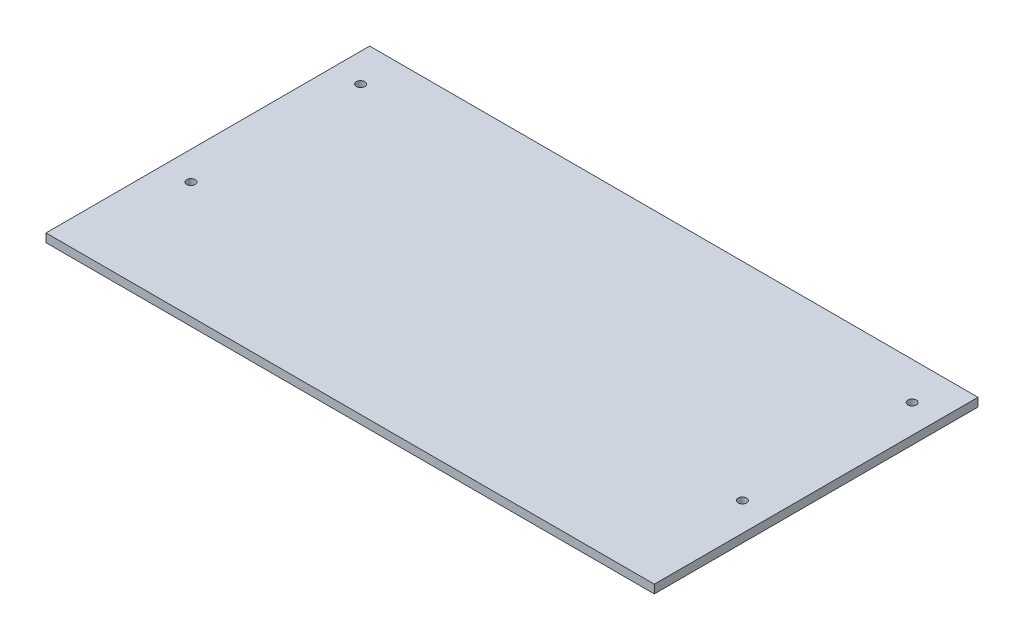
ISO-10303-21;
HEADER;
FILE_DESCRIPTION(('STEP AP214'),'2;1');
FILE_NAME('part.step','',(''),(''),'','','');
FILE_SCHEMA(('AUTOMOTIVE_DESIGN { 1 0 10303 214 1 1 1 1 }'));
ENDSEC;
DATA;
#1=APPLICATION_CONTEXT('core data for automotive mechanical design processes');
#2=APPLICATION_PROTOCOL_DEFINITION('international standard','automotive_design',2000,#1);
#3=PRODUCT_CONTEXT('',#1,'mechanical');
#4=PRODUCT('Part','Part','',(#3));
#5=PRODUCT_RELATED_PRODUCT_CATEGORY('part','',(#4));
#6=PRODUCT_DEFINITION_FORMATION('','',#4);
#7=PRODUCT_DEFINITION_CONTEXT('part definition',#1,'design');
#8=PRODUCT_DEFINITION('design','',#6,#7);
#9=PRODUCT_DEFINITION_SHAPE('','',#8);
#10=(LENGTH_UNIT() NAMED_UNIT(*) SI_UNIT(.MILLI.,.METRE.));
#11=(NAMED_UNIT(*) PLANE_ANGLE_UNIT() SI_UNIT($,.RADIAN.));
#12=(NAMED_UNIT(*) SI_UNIT($,.STERADIAN.) SOLID_ANGLE_UNIT());
#13=UNCERTAINTY_MEASURE_WITH_UNIT(LENGTH_MEASURE(1.E-05),#10,'distance_accuracy_value','');
#14=(GEOMETRIC_REPRESENTATION_CONTEXT(3) GLOBAL_UNCERTAINTY_ASSIGNED_CONTEXT((#13)) GLOBAL_UNIT_ASSIGNED_CONTEXT((#10,
#11,#12)) REPRESENTATION_CONTEXT('',''));
#15=CARTESIAN_POINT('',(0.,0.,0.));
#16=DIRECTION('',(0.,0.,1.));
#17=DIRECTION('',(1.,0.,0.));
#18=AXIS2_PLACEMENT_3D('',#15,#16,#17);
#19=CARTESIAN_POINT('',(0.,3.,0.));
#20=DIRECTION('',(0.,-1.,0.));
#21=DIRECTION('',(0.,0.,-1.));
#22=AXIS2_PLACEMENT_3D('',#19,#20,#21);
#23=PLANE('',#22);
#24=DIRECTION('',(0.,0.,-1.));
#25=VECTOR('',#24,1.);
#26=CARTESIAN_POINT('',(107.545,3.,24.1233569512786));
#27=LINE('',#26,#25);
#28=CARTESIAN_POINT('',(107.545,3.,24.1233569512786));
#29=VERTEX_POINT('',#28);
#30=CARTESIAN_POINT('',(107.545,3.,-90.3123533494948));
#31=VERTEX_POINT('',#30);
#32=EDGE_CURVE('E93',#29,#31,#27,.T.);
#33=ORIENTED_EDGE('',*,*,#32,.T.);
#34=DIRECTION('',(-1.,0.,0.));
#35=VECTOR('',#34,1.);
#36=CARTESIAN_POINT('',(-107.545,3.,-90.3123533494948));
#37=LINE('',#36,#35);
#38=CARTESIAN_POINT('',(-107.545,3.,-90.3123533494948));
#39=VERTEX_POINT('',#38);
#40=EDGE_CURVE('E88',#31,#39,#37,.T.);
#41=ORIENTED_EDGE('',*,*,#40,.T.);
#42=DIRECTION('',(0.,0.,1.));
#43=VECTOR('',#42,1.);
#44=CARTESIAN_POINT('',(-107.545,3.,-90.3123533494948));
#45=LINE('',#44,#43);
#46=CARTESIAN_POINT('',(-107.545,3.,24.1233569512786));
#47=VERTEX_POINT('',#46);
#48=EDGE_CURVE('E91',#39,#47,#45,.T.);
#49=ORIENTED_EDGE('',*,*,#48,.T.);
#50=DIRECTION('',(1.,0.,0.));
#51=VECTOR('',#50,1.);
#52=CARTESIAN_POINT('',(-107.545,3.,24.1233569512786));
#53=LINE('',#52,#51);
#54=EDGE_CURVE('E58',#47,#29,#53,.T.);
#55=ORIENTED_EDGE('',*,*,#54,.T.);
#56=EDGE_LOOP('',(#33,#41,#49,#55));
#57=FACE_BOUND('',#56,.T.);
#58=CARTESIAN_POINT('',(-97.495,3.,-77.0727083333333));
#59=DIRECTION('',(0.,1.,0.));
#60=DIRECTION('',(0.,0.,1.));
#61=AXIS2_PLACEMENT_3D('',#58,#59,#60);
#62=CIRCLE('',#61,1.5);
#63=CARTESIAN_POINT('',(-97.495,3.,-75.5727083333333));
#64=VERTEX_POINT('',#63);
#65=EDGE_CURVE('E108',#64,#64,#62,.T.);
#66=ORIENTED_EDGE('',*,*,#65,.F.);
#67=EDGE_LOOP('',(#66));
#68=FACE_BOUND('',#67,.T.);
#69=CARTESIAN_POINT('',(97.495,3.,-77.0727083333333));
#70=DIRECTION('',(0.,1.,0.));
#71=DIRECTION('',(0.,0.,1.));
#72=AXIS2_PLACEMENT_3D('',#69,#70,#71);
#73=CIRCLE('',#72,1.5);
#74=CARTESIAN_POINT('',(97.495,3.,-75.5727083333333));
#75=VERTEX_POINT('',#74);
#76=EDGE_CURVE('E123',#75,#75,#73,.T.);
#77=ORIENTED_EDGE('',*,*,#76,.F.);
#78=EDGE_LOOP('',(#77));
#79=FACE_BOUND('',#78,.T.);
#80=CARTESIAN_POINT('',(-97.4949999999994,3.,-17.0727083333333));
#81=DIRECTION('',(0.,1.,0.));
#82=DIRECTION('',(0.,0.,1.));
#83=AXIS2_PLACEMENT_3D('',#80,#81,#82);
#84=CIRCLE('',#83,1.5);
#85=CARTESIAN_POINT('',(-97.4949999999994,3.,-15.5727083333333));
#86=VERTEX_POINT('',#85);
#87=EDGE_CURVE('E129',#86,#86,#84,.T.);
#88=ORIENTED_EDGE('',*,*,#87,.F.);
#89=EDGE_LOOP('',(#88));
#90=FACE_BOUND('',#89,.T.);
#91=CARTESIAN_POINT('',(97.4950000000006,3.,-17.0727083333333));
#92=DIRECTION('',(0.,1.,0.));
#93=DIRECTION('',(0.,0.,1.));
#94=AXIS2_PLACEMENT_3D('',#91,#92,#93);
#95=CIRCLE('',#94,1.5);
#96=CARTESIAN_POINT('',(97.4950000000006,3.,-15.5727083333333));
#97=VERTEX_POINT('',#96);
#98=EDGE_CURVE('E135',#97,#97,#95,.T.);
#99=ORIENTED_EDGE('',*,*,#98,.F.);
#100=EDGE_LOOP('',(#99));
#101=FACE_BOUND('',#100,.T.);
#102=ADVANCED_FACE('F41',(#57,#68,#79,#90,#101),#23,.F.);
#103=CARTESIAN_POINT('',(0.,0.,0.));
#104=DIRECTION('',(0.,-1.,0.));
#105=DIRECTION('',(0.,0.,-1.));
#106=AXIS2_PLACEMENT_3D('',#103,#104,#105);
#107=PLANE('',#106);
#108=CARTESIAN_POINT('',(-97.4949999999994,0.,-17.0727083333333));
#109=DIRECTION('',(0.,1.,0.));
#110=DIRECTION('',(0.,0.,1.));
#111=AXIS2_PLACEMENT_3D('',#108,#109,#110);
#112=CIRCLE('',#111,1.5);
#113=CARTESIAN_POINT('',(-97.4949999999994,0.,-15.5727083333333));
#114=VERTEX_POINT('',#113);
#115=EDGE_CURVE('E132',#114,#114,#112,.T.);
#116=ORIENTED_EDGE('',*,*,#115,.T.);
#117=EDGE_LOOP('',(#116));
#118=FACE_BOUND('',#117,.T.);
#119=CARTESIAN_POINT('',(-97.495,0.,-77.0727083333333));
#120=DIRECTION('',(0.,1.,0.));
#121=DIRECTION('',(0.,0.,1.));
#122=AXIS2_PLACEMENT_3D('',#119,#120,#121);
#123=CIRCLE('',#122,1.5);
#124=CARTESIAN_POINT('',(-97.495,0.,-75.5727083333333));
#125=VERTEX_POINT('',#124);
#126=EDGE_CURVE('E120',#125,#125,#123,.T.);
#127=ORIENTED_EDGE('',*,*,#126,.T.);
#128=EDGE_LOOP('',(#127));
#129=FACE_BOUND('',#128,.T.);
#130=DIRECTION('',(0.,0.,-1.));
#131=VECTOR('',#130,1.);
#132=CARTESIAN_POINT('',(107.545,0.,24.1233569512786));
#133=LINE('',#132,#131);
#134=CARTESIAN_POINT('',(107.545,0.,24.1233569512786));
#135=VERTEX_POINT('',#134);
#136=CARTESIAN_POINT('',(107.545,0.,-90.3123533494948));
#137=VERTEX_POINT('',#136);
#138=EDGE_CURVE('E105',#135,#137,#133,.T.);
#139=ORIENTED_EDGE('',*,*,#138,.F.);
#140=DIRECTION('',(1.,0.,0.));
#141=VECTOR('',#140,1.);
#142=CARTESIAN_POINT('',(-107.545,0.,24.1233569512786));
#143=LINE('',#142,#141);
#144=CARTESIAN_POINT('',(-107.545,0.,24.1233569512786));
#145=VERTEX_POINT('',#144);
#146=EDGE_CURVE('E81',#145,#135,#143,.T.);
#147=ORIENTED_EDGE('',*,*,#146,.F.);
#148=DIRECTION('',(0.,0.,1.));
#149=VECTOR('',#148,1.);
#150=CARTESIAN_POINT('',(-107.545,0.,-90.3123533494948));
#151=LINE('',#150,#149);
#152=CARTESIAN_POINT('',(-107.545,0.,-90.3123533494948));
#153=VERTEX_POINT('',#152);
#154=EDGE_CURVE('E75',#153,#145,#151,.T.);
#155=ORIENTED_EDGE('',*,*,#154,.F.);
#156=DIRECTION('',(-1.,0.,0.));
#157=VECTOR('',#156,1.);
#158=CARTESIAN_POINT('',(-107.545,0.,-90.3123533494948));
#159=LINE('',#158,#157);
#160=EDGE_CURVE('E97',#137,#153,#159,.T.);
#161=ORIENTED_EDGE('',*,*,#160,.F.);
#162=EDGE_LOOP('',(#139,#147,#155,#161));
#163=FACE_BOUND('',#162,.T.);
#164=CARTESIAN_POINT('',(97.495,0.,-77.0727083333333));
#165=DIRECTION('',(0.,1.,0.));
#166=DIRECTION('',(0.,0.,1.));
#167=AXIS2_PLACEMENT_3D('',#164,#165,#166);
#168=CIRCLE('',#167,1.5);
#169=CARTESIAN_POINT('',(97.495,0.,-75.5727083333333));
#170=VERTEX_POINT('',#169);
#171=EDGE_CURVE('E126',#170,#170,#168,.T.);
#172=ORIENTED_EDGE('',*,*,#171,.T.);
#173=EDGE_LOOP('',(#172));
#174=FACE_BOUND('',#173,.T.);
#175=CARTESIAN_POINT('',(97.4950000000006,0.,-17.0727083333333));
#176=DIRECTION('',(0.,1.,0.));
#177=DIRECTION('',(0.,0.,1.));
#178=AXIS2_PLACEMENT_3D('',#175,#176,#177);
#179=CIRCLE('',#178,1.5);
#180=CARTESIAN_POINT('',(97.4950000000006,0.,-15.5727083333333));
#181=VERTEX_POINT('',#180);
#182=EDGE_CURVE('E138',#181,#181,#179,.T.);
#183=ORIENTED_EDGE('',*,*,#182,.T.);
#184=EDGE_LOOP('',(#183));
#185=FACE_BOUND('',#184,.T.);
#186=ADVANCED_FACE('F116',(#118,#129,#163,#174,#185),#107,.T.);
#187=CARTESIAN_POINT('',(107.545,3.,24.1233569512786));
#188=DIRECTION('',(-1.,0.,0.));
#189=DIRECTION('',(0.,0.,1.));
#190=AXIS2_PLACEMENT_3D('',#187,#188,#189);
#191=PLANE('',#190);
#192=ORIENTED_EDGE('',*,*,#138,.T.);
#193=DIRECTION('',(0.,-1.,0.));
#194=VECTOR('',#193,1.);
#195=CARTESIAN_POINT('',(107.545,3.,-90.3123533494948));
#196=LINE('',#195,#194);
#197=EDGE_CURVE('E11',#31,#137,#196,.T.);
#198=ORIENTED_EDGE('',*,*,#197,.F.);
#199=ORIENTED_EDGE('',*,*,#32,.F.);
#200=DIRECTION('',(0.,-1.,0.));
#201=VECTOR('',#200,1.);
#202=CARTESIAN_POINT('',(107.545,3.,24.1233569512786));
#203=LINE('',#202,#201);
#204=EDGE_CURVE('E101',#29,#135,#203,.T.);
#205=ORIENTED_EDGE('',*,*,#204,.T.);
#206=EDGE_LOOP('',(#192,#198,#199,#205));
#207=FACE_BOUND('',#206,.T.);
#208=ADVANCED_FACE('F43',(#207),#191,.F.);
#209=CARTESIAN_POINT('',(-107.545,3.,-90.3123533494948));
#210=DIRECTION('',(0.,0.,1.));
#211=DIRECTION('',(1.,0.,0.));
#212=AXIS2_PLACEMENT_3D('',#209,#210,#211);
#213=PLANE('',#212);
#214=ORIENTED_EDGE('',*,*,#160,.T.);
#215=DIRECTION('',(0.,-1.,0.));
#216=VECTOR('',#215,1.);
#217=CARTESIAN_POINT('',(-107.545,3.,-90.3123533494948));
#218=LINE('',#217,#216);
#219=EDGE_CURVE('E50',#39,#153,#218,.T.);
#220=ORIENTED_EDGE('',*,*,#219,.F.);
#221=ORIENTED_EDGE('',*,*,#40,.F.);
#222=ORIENTED_EDGE('',*,*,#197,.T.);
#223=EDGE_LOOP('',(#214,#220,#221,#222));
#224=FACE_BOUND('',#223,.T.);
#225=ADVANCED_FACE('F96',(#224),#213,.F.);
#226=CARTESIAN_POINT('',(-107.545,3.,-90.3123533494948));
#227=DIRECTION('',(1.,0.,0.));
#228=DIRECTION('',(0.,0.,-1.));
#229=AXIS2_PLACEMENT_3D('',#226,#227,#228);
#230=PLANE('',#229);
#231=ORIENTED_EDGE('',*,*,#154,.T.);
#232=DIRECTION('',(0.,-1.,0.));
#233=VECTOR('',#232,1.);
#234=CARTESIAN_POINT('',(-107.545,3.,24.1233569512786));
#235=LINE('',#234,#233);
#236=EDGE_CURVE('E98',#47,#145,#235,.T.);
#237=ORIENTED_EDGE('',*,*,#236,.F.);
#238=ORIENTED_EDGE('',*,*,#48,.F.);
#239=ORIENTED_EDGE('',*,*,#219,.T.);
#240=EDGE_LOOP('',(#231,#237,#238,#239));
#241=FACE_BOUND('',#240,.T.);
#242=ADVANCED_FACE('F99',(#241),#230,.F.);
#243=CARTESIAN_POINT('',(-107.545,3.,24.1233569512786));
#244=DIRECTION('',(0.,0.,-1.));
#245=DIRECTION('',(-1.,0.,0.));
#246=AXIS2_PLACEMENT_3D('',#243,#244,#245);
#247=PLANE('',#246);
#248=ORIENTED_EDGE('',*,*,#146,.T.);
#249=ORIENTED_EDGE('',*,*,#204,.F.);
#250=ORIENTED_EDGE('',*,*,#54,.F.);
#251=ORIENTED_EDGE('',*,*,#236,.T.);
#252=EDGE_LOOP('',(#248,#249,#250,#251));
#253=FACE_BOUND('',#252,.T.);
#254=ADVANCED_FACE('F113',(#253),#247,.F.);
#255=CARTESIAN_POINT('',(-97.495,3.,-77.0727083333333));
#256=DIRECTION('',(0.,-1.,0.));
#257=DIRECTION('',(0.,0.,-1.));
#258=AXIS2_PLACEMENT_3D('',#255,#256,#257);
#259=CYLINDRICAL_SURFACE('',#258,1.5);
#260=ORIENTED_EDGE('',*,*,#65,.T.);
#261=EDGE_LOOP('',(#260));
#262=FACE_BOUND('',#261,.T.);
#263=ORIENTED_EDGE('',*,*,#126,.F.);
#264=EDGE_LOOP('',(#263));
#265=FACE_BOUND('',#264,.T.);
#266=ADVANCED_FACE('F155',(#262,#265),#259,.F.);
#267=CARTESIAN_POINT('',(97.495,3.,-77.0727083333333));
#268=DIRECTION('',(0.,-1.,0.));
#269=DIRECTION('',(0.,0.,-1.));
#270=AXIS2_PLACEMENT_3D('',#267,#268,#269);
#271=CYLINDRICAL_SURFACE('',#270,1.5);
#272=ORIENTED_EDGE('',*,*,#76,.T.);
#273=EDGE_LOOP('',(#272));
#274=FACE_BOUND('',#273,.T.);
#275=ORIENTED_EDGE('',*,*,#171,.F.);
#276=EDGE_LOOP('',(#275));
#277=FACE_BOUND('',#276,.T.);
#278=ADVANCED_FACE('F200',(#274,#277),#271,.F.);
#279=CARTESIAN_POINT('',(-97.4949999999994,3.,-17.0727083333333));
#280=DIRECTION('',(0.,-1.,0.));
#281=DIRECTION('',(0.,0.,-1.));
#282=AXIS2_PLACEMENT_3D('',#279,#280,#281);
#283=CYLINDRICAL_SURFACE('',#282,1.5);
#284=ORIENTED_EDGE('',*,*,#87,.T.);
#285=EDGE_LOOP('',(#284));
#286=FACE_BOUND('',#285,.T.);
#287=ORIENTED_EDGE('',*,*,#115,.F.);
#288=EDGE_LOOP('',(#287));
#289=FACE_BOUND('',#288,.T.);
#290=ADVANCED_FACE('F208',(#286,#289),#283,.F.);
#291=CARTESIAN_POINT('',(97.4950000000006,3.,-17.0727083333333));
#292=DIRECTION('',(0.,-1.,0.));
#293=DIRECTION('',(0.,0.,-1.));
#294=AXIS2_PLACEMENT_3D('',#291,#292,#293);
#295=CYLINDRICAL_SURFACE('',#294,1.5);
#296=ORIENTED_EDGE('',*,*,#98,.T.);
#297=EDGE_LOOP('',(#296));
#298=FACE_BOUND('',#297,.T.);
#299=ORIENTED_EDGE('',*,*,#182,.F.);
#300=EDGE_LOOP('',(#299));
#301=FACE_BOUND('',#300,.T.);
#302=ADVANCED_FACE('F144',(#298,#301),#295,.F.);
#303=CLOSED_SHELL('',(#102,#186,#208,#225,#242,#254,#266,#278,#290,#302));
#304=MANIFOLD_SOLID_BREP('B2',#303);
#305=ADVANCED_BREP_SHAPE_REPRESENTATION('',(#18,#304),#14);
#306=SHAPE_DEFINITION_REPRESENTATION(#9,#305);
ENDSEC;
END-ISO-10303-21;
